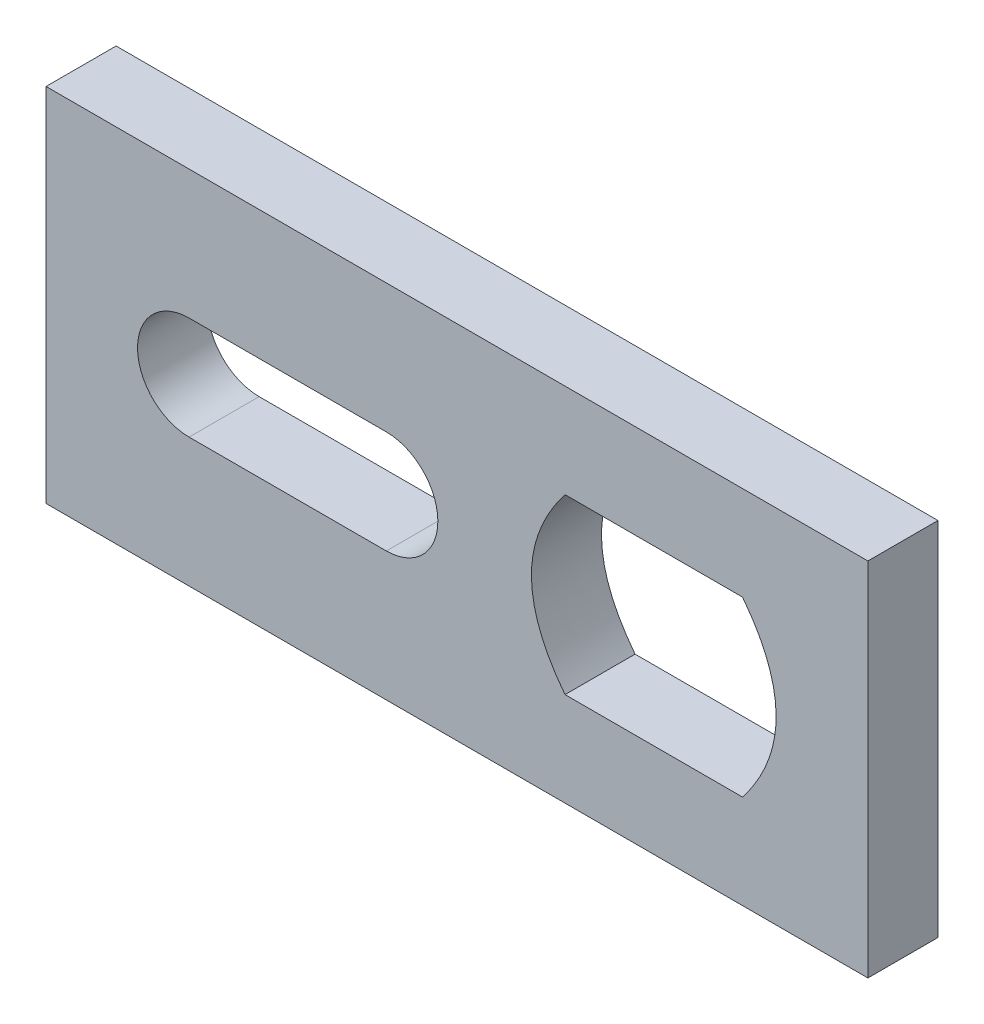
ISO-10303-21;
HEADER;
FILE_DESCRIPTION(('STEP AP214'),'2;1');
FILE_NAME('part.step','',(''),(''),'','','');
FILE_SCHEMA(('AUTOMOTIVE_DESIGN { 1 0 10303 214 1 1 1 1 }'));
ENDSEC;
DATA;
#1=APPLICATION_CONTEXT('core data for automotive mechanical design processes');
#2=APPLICATION_PROTOCOL_DEFINITION('international standard','automotive_design',2000,#1);
#3=PRODUCT_CONTEXT('',#1,'mechanical');
#4=PRODUCT('Part','Part','',(#3));
#5=PRODUCT_RELATED_PRODUCT_CATEGORY('part','',(#4));
#6=PRODUCT_DEFINITION_FORMATION('','',#4);
#7=PRODUCT_DEFINITION_CONTEXT('part definition',#1,'design');
#8=PRODUCT_DEFINITION('design','',#6,#7);
#9=PRODUCT_DEFINITION_SHAPE('','',#8);
#10=(LENGTH_UNIT() NAMED_UNIT(*) SI_UNIT(.MILLI.,.METRE.));
#11=(NAMED_UNIT(*) PLANE_ANGLE_UNIT() SI_UNIT($,.RADIAN.));
#12=(NAMED_UNIT(*) SI_UNIT($,.STERADIAN.) SOLID_ANGLE_UNIT());
#13=UNCERTAINTY_MEASURE_WITH_UNIT(LENGTH_MEASURE(1.E-05),#10,'distance_accuracy_value','');
#14=(GEOMETRIC_REPRESENTATION_CONTEXT(3) GLOBAL_UNCERTAINTY_ASSIGNED_CONTEXT((#13)) GLOBAL_UNIT_ASSIGNED_CONTEXT((#10,
#11,#12)) REPRESENTATION_CONTEXT('',''));
#15=CARTESIAN_POINT('',(0.,0.,0.));
#16=DIRECTION('',(0.,0.,1.));
#17=DIRECTION('',(1.,0.,0.));
#18=AXIS2_PLACEMENT_3D('',#15,#16,#17);
#19=CARTESIAN_POINT('',(0.,0.,5.81));
#20=DIRECTION('',(0.,1.,0.));
#21=DIRECTION('',(0.,0.,1.));
#22=AXIS2_PLACEMENT_3D('',#19,#20,#21);
#23=PLANE('',#22);
#24=DIRECTION('',(1.,0.,0.));
#25=VECTOR('',#24,1.);
#26=CARTESIAN_POINT('',(0.,0.,0.));
#27=LINE('',#26,#25);
#28=CARTESIAN_POINT('',(0.,0.,0.));
#29=VERTEX_POINT('',#28);
#30=CARTESIAN_POINT('',(68.15,0.,0.));
#31=VERTEX_POINT('',#30);
#32=EDGE_CURVE('E210',#29,#31,#27,.T.);
#33=ORIENTED_EDGE('',*,*,#32,.T.);
#34=DIRECTION('',(0.,0.,-1.));
#35=VECTOR('',#34,1.);
#36=CARTESIAN_POINT('',(68.15,0.,5.81));
#37=LINE('',#36,#35);
#38=CARTESIAN_POINT('',(68.15,0.,5.81));
#39=VERTEX_POINT('',#38);
#40=EDGE_CURVE('E11',#39,#31,#37,.T.);
#41=ORIENTED_EDGE('',*,*,#40,.F.);
#42=DIRECTION('',(1.,0.,0.));
#43=VECTOR('',#42,1.);
#44=CARTESIAN_POINT('',(0.,0.,5.81));
#45=LINE('',#44,#43);
#46=CARTESIAN_POINT('',(0.,0.,5.81));
#47=VERTEX_POINT('',#46);
#48=EDGE_CURVE('E149',#47,#39,#45,.T.);
#49=ORIENTED_EDGE('',*,*,#48,.F.);
#50=DIRECTION('',(0.,0.,-1.));
#51=VECTOR('',#50,1.);
#52=CARTESIAN_POINT('',(0.,0.,5.81));
#53=LINE('',#52,#51);
#54=EDGE_CURVE('E64',#47,#29,#53,.T.);
#55=ORIENTED_EDGE('',*,*,#54,.T.);
#56=EDGE_LOOP('',(#33,#41,#49,#55));
#57=FACE_BOUND('',#56,.T.);
#58=ADVANCED_FACE('F43',(#57),#23,.F.);
#59=CARTESIAN_POINT('',(68.15,0.,5.81));
#60=DIRECTION('',(-1.,0.,0.));
#61=DIRECTION('',(0.,0.,1.));
#62=AXIS2_PLACEMENT_3D('',#59,#60,#61);
#63=PLANE('',#62);
#64=DIRECTION('',(0.,1.,0.));
#65=VECTOR('',#64,1.);
#66=CARTESIAN_POINT('',(68.15,0.,0.));
#67=LINE('',#66,#65);
#68=CARTESIAN_POINT('',(68.15,29.95,0.));
#69=VERTEX_POINT('',#68);
#70=EDGE_CURVE('E156',#31,#69,#67,.T.);
#71=ORIENTED_EDGE('',*,*,#70,.T.);
#72=DIRECTION('',(0.,0.,-1.));
#73=VECTOR('',#72,1.);
#74=CARTESIAN_POINT('',(68.15,29.95,5.81));
#75=LINE('',#74,#73);
#76=CARTESIAN_POINT('',(68.15,29.95,5.81));
#77=VERTEX_POINT('',#76);
#78=EDGE_CURVE('E55',#77,#69,#75,.T.);
#79=ORIENTED_EDGE('',*,*,#78,.F.);
#80=DIRECTION('',(0.,1.,0.));
#81=VECTOR('',#80,1.);
#82=CARTESIAN_POINT('',(68.15,0.,5.81));
#83=LINE('',#82,#81);
#84=EDGE_CURVE('E143',#39,#77,#83,.T.);
#85=ORIENTED_EDGE('',*,*,#84,.F.);
#86=ORIENTED_EDGE('',*,*,#40,.T.);
#87=EDGE_LOOP('',(#71,#79,#85,#86));
#88=FACE_BOUND('',#87,.T.);
#89=ADVANCED_FACE('F155',(#88),#63,.F.);
#90=CARTESIAN_POINT('',(0.,29.95,5.81));
#91=DIRECTION('',(0.,1.,0.));
#92=DIRECTION('',(0.,0.,1.));
#93=AXIS2_PLACEMENT_3D('',#90,#91,#92);
#94=PLANE('',#93);
#95=DIRECTION('',(1.,0.,0.));
#96=VECTOR('',#95,1.);
#97=CARTESIAN_POINT('',(0.,29.95,0.));
#98=LINE('',#97,#96);
#99=CARTESIAN_POINT('',(0.,29.95,0.));
#100=VERTEX_POINT('',#99);
#101=EDGE_CURVE('E215',#100,#69,#98,.T.);
#102=ORIENTED_EDGE('',*,*,#101,.F.);
#103=DIRECTION('',(0.,0.,-1.));
#104=VECTOR('',#103,1.);
#105=CARTESIAN_POINT('',(0.,29.95,5.81));
#106=LINE('',#105,#104);
#107=CARTESIAN_POINT('',(0.,29.95,5.81));
#108=VERTEX_POINT('',#107);
#109=EDGE_CURVE('E102',#108,#100,#106,.T.);
#110=ORIENTED_EDGE('',*,*,#109,.F.);
#111=DIRECTION('',(1.,0.,0.));
#112=VECTOR('',#111,1.);
#113=CARTESIAN_POINT('',(0.,29.95,5.81));
#114=LINE('',#113,#112);
#115=EDGE_CURVE('E148',#108,#77,#114,.T.);
#116=ORIENTED_EDGE('',*,*,#115,.T.);
#117=ORIENTED_EDGE('',*,*,#78,.T.);
#118=EDGE_LOOP('',(#102,#110,#116,#117));
#119=FACE_BOUND('',#118,.T.);
#120=ADVANCED_FACE('F161',(#119),#94,.T.);
#121=CARTESIAN_POINT('',(0.,10.7,5.81));
#122=DIRECTION('',(0.,1.,0.));
#123=DIRECTION('',(-1.,0.,0.));
#124=AXIS2_PLACEMENT_3D('',#121,#122,#123);
#125=PLANE('',#124);
#126=DIRECTION('',(1.,0.,0.));
#127=VECTOR('',#126,1.);
#128=CARTESIAN_POINT('',(0.,10.7,0.));
#129=LINE('',#128,#127);
#130=CARTESIAN_POINT('',(11.86,10.7,0.));
#131=VERTEX_POINT('',#130);
#132=CARTESIAN_POINT('',(28.215,10.7,0.));
#133=VERTEX_POINT('',#132);
#134=EDGE_CURVE('E194',#131,#133,#129,.T.);
#135=ORIENTED_EDGE('',*,*,#134,.F.);
#136=DIRECTION('',(0.,0.,-1.));
#137=VECTOR('',#136,1.);
#138=CARTESIAN_POINT('',(11.86,10.7,5.81));
#139=LINE('',#138,#137);
#140=CARTESIAN_POINT('',(11.86,10.7,5.81));
#141=VERTEX_POINT('',#140);
#142=EDGE_CURVE('E224',#141,#131,#139,.T.);
#143=ORIENTED_EDGE('',*,*,#142,.F.);
#144=DIRECTION('',(1.,0.,0.));
#145=VECTOR('',#144,1.);
#146=CARTESIAN_POINT('',(0.,10.7,5.81));
#147=LINE('',#146,#145);
#148=CARTESIAN_POINT('',(28.215,10.7,5.81));
#149=VERTEX_POINT('',#148);
#150=EDGE_CURVE('E269',#141,#149,#147,.T.);
#151=ORIENTED_EDGE('',*,*,#150,.T.);
#152=DIRECTION('',(0.,0.,-1.));
#153=VECTOR('',#152,1.);
#154=CARTESIAN_POINT('',(28.215,10.7,5.81));
#155=LINE('',#154,#153);
#156=EDGE_CURVE('E227',#149,#133,#155,.T.);
#157=ORIENTED_EDGE('',*,*,#156,.T.);
#158=EDGE_LOOP('',(#135,#143,#151,#157));
#159=FACE_BOUND('',#158,.T.);
#160=ADVANCED_FACE('F309',(#159),#125,.T.);
#161=CARTESIAN_POINT('',(11.86,14.975,5.81));
#162=DIRECTION('',(0.,0.,-1.));
#163=DIRECTION('',(-1.,0.,0.));
#164=AXIS2_PLACEMENT_3D('',#161,#162,#163);
#165=CYLINDRICAL_SURFACE('',#164,4.275);
#166=CARTESIAN_POINT('',(11.86,14.975,0.));
#167=DIRECTION('',(0.,0.,1.));
#168=DIRECTION('',(1.,0.,0.));
#169=AXIS2_PLACEMENT_3D('',#166,#167,#168);
#170=CIRCLE('',#169,4.275);
#171=CARTESIAN_POINT('',(11.86,19.25,0.));
#172=VERTEX_POINT('',#171);
#173=EDGE_CURVE('E198',#172,#131,#170,.T.);
#174=ORIENTED_EDGE('',*,*,#173,.F.);
#175=DIRECTION('',(0.,0.,-1.));
#176=VECTOR('',#175,1.);
#177=CARTESIAN_POINT('',(11.86,19.25,5.81));
#178=LINE('',#177,#176);
#179=CARTESIAN_POINT('',(11.86,19.25,5.81));
#180=VERTEX_POINT('',#179);
#181=EDGE_CURVE('E233',#180,#172,#178,.T.);
#182=ORIENTED_EDGE('',*,*,#181,.F.);
#183=CARTESIAN_POINT('',(11.86,14.975,5.81));
#184=DIRECTION('',(0.,0.,1.));
#185=DIRECTION('',(1.,0.,0.));
#186=AXIS2_PLACEMENT_3D('',#183,#184,#185);
#187=CIRCLE('',#186,4.275);
#188=EDGE_CURVE('E275',#180,#141,#187,.T.);
#189=ORIENTED_EDGE('',*,*,#188,.T.);
#190=ORIENTED_EDGE('',*,*,#142,.T.);
#191=EDGE_LOOP('',(#174,#182,#189,#190));
#192=FACE_BOUND('',#191,.T.);
#193=ADVANCED_FACE('F311',(#192),#165,.F.);
#194=CARTESIAN_POINT('',(0.,19.25,5.81));
#195=DIRECTION('',(0.,1.,0.));
#196=DIRECTION('',(0.,0.,1.));
#197=AXIS2_PLACEMENT_3D('',#194,#195,#196);
#198=PLANE('',#197);
#199=DIRECTION('',(1.,0.,0.));
#200=VECTOR('',#199,1.);
#201=CARTESIAN_POINT('',(0.,19.25,0.));
#202=LINE('',#201,#200);
#203=CARTESIAN_POINT('',(28.215,19.25,0.));
#204=VERTEX_POINT('',#203);
#205=EDGE_CURVE('E202',#172,#204,#202,.T.);
#206=ORIENTED_EDGE('',*,*,#205,.T.);
#207=DIRECTION('',(0.,0.,-1.));
#208=VECTOR('',#207,1.);
#209=CARTESIAN_POINT('',(28.215,19.25,5.81));
#210=LINE('',#209,#208);
#211=CARTESIAN_POINT('',(28.215,19.25,5.81));
#212=VERTEX_POINT('',#211);
#213=EDGE_CURVE('E230',#212,#204,#210,.T.);
#214=ORIENTED_EDGE('',*,*,#213,.F.);
#215=DIRECTION('',(1.,0.,0.));
#216=VECTOR('',#215,1.);
#217=CARTESIAN_POINT('',(0.,19.25,5.81));
#218=LINE('',#217,#216);
#219=EDGE_CURVE('E286',#180,#212,#218,.T.);
#220=ORIENTED_EDGE('',*,*,#219,.F.);
#221=ORIENTED_EDGE('',*,*,#181,.T.);
#222=EDGE_LOOP('',(#206,#214,#220,#221));
#223=FACE_BOUND('',#222,.T.);
#224=ADVANCED_FACE('F303',(#223),#198,.F.);
#225=CARTESIAN_POINT('',(57.755,22.155,5.81));
#226=CARTESIAN_POINT('',(63.325,14.975,5.81));
#227=CARTESIAN_POINT('',(57.755,7.795,5.81));
#228=B_SPLINE_CURVE_WITH_KNOTS('',2,(#225,#226,#227),.UNSPECIFIED.,.F.,.F.,(3,3),(0.,1.),.UNSPECIFIED.);
#229=DIRECTION('',(0.,0.,-1.));
#230=VECTOR('',#229,1.);
#231=SURFACE_OF_LINEAR_EXTRUSION('',#228,#230);
#232=CARTESIAN_POINT('',(57.755,22.155,0.));
#233=CARTESIAN_POINT('',(63.325,14.975,0.));
#234=CARTESIAN_POINT('',(57.755,7.795,0.));
#235=B_SPLINE_CURVE_WITH_KNOTS('',2,(#232,#233,#234),.UNSPECIFIED.,.F.,.F.,(3,3),(0.,1.),.UNSPECIFIED.);
#236=CARTESIAN_POINT('',(57.755,22.155,0.));
#237=VERTEX_POINT('',#236);
#238=CARTESIAN_POINT('',(57.755,7.795,0.));
#239=VERTEX_POINT('',#238);
#240=EDGE_CURVE('E170',#237,#239,#235,.T.);
#241=ORIENTED_EDGE('',*,*,#240,.T.);
#242=DIRECTION('',(0.,0.,-1.));
#243=VECTOR('',#242,1.);
#244=CARTESIAN_POINT('',(57.755,7.795,5.81));
#245=LINE('',#244,#243);
#246=CARTESIAN_POINT('',(57.755,7.795,5.81));
#247=VERTEX_POINT('',#246);
#248=EDGE_CURVE('E48',#247,#239,#245,.T.);
#249=ORIENTED_EDGE('',*,*,#248,.F.);
#250=CARTESIAN_POINT('',(57.755,22.155,5.81));
#251=VERTEX_POINT('',#250);
#252=EDGE_CURVE('E115',#251,#247,#228,.T.);
#253=ORIENTED_EDGE('',*,*,#252,.F.);
#254=DIRECTION('',(0.,0.,-1.));
#255=VECTOR('',#254,1.);
#256=CARTESIAN_POINT('',(57.755,22.155,5.81));
#257=LINE('',#256,#255);
#258=EDGE_CURVE('E166',#251,#237,#257,.T.);
#259=ORIENTED_EDGE('',*,*,#258,.T.);
#260=EDGE_LOOP('',(#241,#249,#253,#259));
#261=FACE_BOUND('',#260,.T.);
#262=ADVANCED_FACE('F45',(#261),#231,.F.);
#263=CARTESIAN_POINT('',(0.,7.795,5.81));
#264=DIRECTION('',(0.,1.,0.));
#265=DIRECTION('',(0.,0.,1.));
#266=AXIS2_PLACEMENT_3D('',#263,#264,#265);
#267=PLANE('',#266);
#268=DIRECTION('',(1.,0.,0.));
#269=VECTOR('',#268,1.);
#270=CARTESIAN_POINT('',(0.,7.795,0.));
#271=LINE('',#270,#269);
#272=CARTESIAN_POINT('',(43.035,7.795,0.));
#273=VERTEX_POINT('',#272);
#274=EDGE_CURVE('E176',#273,#239,#271,.T.);
#275=ORIENTED_EDGE('',*,*,#274,.F.);
#276=DIRECTION('',(0.,0.,-1.));
#277=VECTOR('',#276,1.);
#278=CARTESIAN_POINT('',(43.035,7.795,5.81));
#279=LINE('',#278,#277);
#280=CARTESIAN_POINT('',(43.035,7.795,5.81));
#281=VERTEX_POINT('',#280);
#282=EDGE_CURVE('E244',#281,#273,#279,.T.);
#283=ORIENTED_EDGE('',*,*,#282,.F.);
#284=DIRECTION('',(1.,0.,0.));
#285=VECTOR('',#284,1.);
#286=CARTESIAN_POINT('',(0.,7.795,5.81));
#287=LINE('',#286,#285);
#288=EDGE_CURVE('E254',#281,#247,#287,.T.);
#289=ORIENTED_EDGE('',*,*,#288,.T.);
#290=ORIENTED_EDGE('',*,*,#248,.T.);
#291=EDGE_LOOP('',(#275,#283,#289,#290));
#292=FACE_BOUND('',#291,.T.);
#293=ADVANCED_FACE('F253',(#292),#267,.T.);
#294=CARTESIAN_POINT('',(43.035,7.795,5.81));
#295=CARTESIAN_POINT('',(37.465,14.975,5.81));
#296=CARTESIAN_POINT('',(43.035,22.155,5.81));
#297=B_SPLINE_CURVE_WITH_KNOTS('',2,(#294,#295,#296),.UNSPECIFIED.,.F.,.F.,(3,3),(0.,1.),.UNSPECIFIED.);
#298=DIRECTION('',(0.,0.,-1.));
#299=VECTOR('',#298,1.);
#300=SURFACE_OF_LINEAR_EXTRUSION('',#297,#299);
#301=CARTESIAN_POINT('',(43.035,7.795,0.));
#302=CARTESIAN_POINT('',(37.465,14.975,0.));
#303=CARTESIAN_POINT('',(43.035,22.155,0.));
#304=B_SPLINE_CURVE_WITH_KNOTS('',2,(#301,#302,#303),.UNSPECIFIED.,.F.,.F.,(3,3),(0.,1.),.UNSPECIFIED.);
#305=CARTESIAN_POINT('',(43.035,22.155,0.));
#306=VERTEX_POINT('',#305);
#307=EDGE_CURVE('E183',#273,#306,#304,.T.);
#308=ORIENTED_EDGE('',*,*,#307,.T.);
#309=DIRECTION('',(0.,0.,-1.));
#310=VECTOR('',#309,1.);
#311=CARTESIAN_POINT('',(43.035,22.155,5.81));
#312=LINE('',#311,#310);
#313=CARTESIAN_POINT('',(43.035,22.155,5.81));
#314=VERTEX_POINT('',#313);
#315=EDGE_CURVE('E241',#314,#306,#312,.T.);
#316=ORIENTED_EDGE('',*,*,#315,.F.);
#317=EDGE_CURVE('E270',#281,#314,#297,.T.);
#318=ORIENTED_EDGE('',*,*,#317,.F.);
#319=ORIENTED_EDGE('',*,*,#282,.T.);
#320=EDGE_LOOP('',(#308,#316,#318,#319));
#321=FACE_BOUND('',#320,.T.);
#322=ADVANCED_FACE('F263',(#321),#300,.F.);
#323=CARTESIAN_POINT('',(28.215,14.975,5.81));
#324=DIRECTION('',(0.,0.,-1.));
#325=DIRECTION('',(-1.,0.,0.));
#326=AXIS2_PLACEMENT_3D('',#323,#324,#325);
#327=CYLINDRICAL_SURFACE('',#326,4.275);
#328=CARTESIAN_POINT('',(28.215,14.975,0.));
#329=DIRECTION('',(0.,0.,1.));
#330=DIRECTION('',(1.,0.,0.));
#331=AXIS2_PLACEMENT_3D('',#328,#329,#330);
#332=CIRCLE('',#331,4.275);
#333=EDGE_CURVE('E206',#133,#204,#332,.T.);
#334=ORIENTED_EDGE('',*,*,#333,.F.);
#335=ORIENTED_EDGE('',*,*,#156,.F.);
#336=CARTESIAN_POINT('',(28.215,14.975,5.81));
#337=DIRECTION('',(0.,0.,1.));
#338=DIRECTION('',(1.,0.,0.));
#339=AXIS2_PLACEMENT_3D('',#336,#337,#338);
#340=CIRCLE('',#339,4.275);
#341=EDGE_CURVE('E289',#149,#212,#340,.T.);
#342=ORIENTED_EDGE('',*,*,#341,.T.);
#343=ORIENTED_EDGE('',*,*,#213,.T.);
#344=EDGE_LOOP('',(#334,#335,#342,#343));
#345=FACE_BOUND('',#344,.T.);
#346=ADVANCED_FACE('F296',(#345),#327,.F.);
#347=CARTESIAN_POINT('',(0.,22.155,5.81));
#348=DIRECTION('',(0.,1.,0.));
#349=DIRECTION('',(0.,0.,1.));
#350=AXIS2_PLACEMENT_3D('',#347,#348,#349);
#351=PLANE('',#350);
#352=DIRECTION('',(1.,0.,0.));
#353=VECTOR('',#352,1.);
#354=CARTESIAN_POINT('',(0.,22.155,0.));
#355=LINE('',#354,#353);
#356=EDGE_CURVE('E188',#306,#237,#355,.T.);
#357=ORIENTED_EDGE('',*,*,#356,.T.);
#358=ORIENTED_EDGE('',*,*,#258,.F.);
#359=DIRECTION('',(1.,0.,0.));
#360=VECTOR('',#359,1.);
#361=CARTESIAN_POINT('',(0.,22.155,5.81));
#362=LINE('',#361,#360);
#363=EDGE_CURVE('E267',#314,#251,#362,.T.);
#364=ORIENTED_EDGE('',*,*,#363,.F.);
#365=ORIENTED_EDGE('',*,*,#315,.T.);
#366=EDGE_LOOP('',(#357,#358,#364,#365));
#367=FACE_BOUND('',#366,.T.);
#368=ADVANCED_FACE('F266',(#367),#351,.F.);
#369=CARTESIAN_POINT('',(0.,0.,5.81));
#370=DIRECTION('',(-1.,0.,0.));
#371=DIRECTION('',(0.,0.,1.));
#372=AXIS2_PLACEMENT_3D('',#369,#370,#371);
#373=PLANE('',#372);
#374=DIRECTION('',(0.,1.,0.));
#375=VECTOR('',#374,1.);
#376=CARTESIAN_POINT('',(0.,0.,0.));
#377=LINE('',#376,#375);
#378=EDGE_CURVE('E218',#29,#100,#377,.T.);
#379=ORIENTED_EDGE('',*,*,#378,.F.);
#380=ORIENTED_EDGE('',*,*,#54,.F.);
#381=DIRECTION('',(0.,1.,0.));
#382=VECTOR('',#381,1.);
#383=CARTESIAN_POINT('',(0.,0.,5.81));
#384=LINE('',#383,#382);
#385=EDGE_CURVE('E163',#47,#108,#384,.T.);
#386=ORIENTED_EDGE('',*,*,#385,.T.);
#387=ORIENTED_EDGE('',*,*,#109,.T.);
#388=EDGE_LOOP('',(#379,#380,#386,#387));
#389=FACE_BOUND('',#388,.T.);
#390=ADVANCED_FACE('F333',(#389),#373,.T.);
#391=CARTESIAN_POINT('',(0.,0.,5.81));
#392=DIRECTION('',(0.,0.,1.));
#393=DIRECTION('',(1.,0.,0.));
#394=AXIS2_PLACEMENT_3D('',#391,#392,#393);
#395=PLANE('',#394);
#396=ORIENTED_EDGE('',*,*,#252,.T.);
#397=ORIENTED_EDGE('',*,*,#288,.F.);
#398=ORIENTED_EDGE('',*,*,#317,.T.);
#399=ORIENTED_EDGE('',*,*,#363,.T.);
#400=EDGE_LOOP('',(#396,#397,#398,#399));
#401=FACE_BOUND('',#400,.T.);
#402=ORIENTED_EDGE('',*,*,#150,.F.);
#403=ORIENTED_EDGE('',*,*,#188,.F.);
#404=ORIENTED_EDGE('',*,*,#219,.T.);
#405=ORIENTED_EDGE('',*,*,#341,.F.);
#406=EDGE_LOOP('',(#402,#403,#404,#405));
#407=FACE_BOUND('',#406,.T.);
#408=ORIENTED_EDGE('',*,*,#48,.T.);
#409=ORIENTED_EDGE('',*,*,#84,.T.);
#410=ORIENTED_EDGE('',*,*,#115,.F.);
#411=ORIENTED_EDGE('',*,*,#385,.F.);
#412=EDGE_LOOP('',(#408,#409,#410,#411));
#413=FACE_BOUND('',#412,.T.);
#414=ADVANCED_FACE('F145',(#401,#407,#413),#395,.T.);
#415=CARTESIAN_POINT('',(0.,0.,0.));
#416=DIRECTION('',(0.,0.,1.));
#417=DIRECTION('',(1.,0.,0.));
#418=AXIS2_PLACEMENT_3D('',#415,#416,#417);
#419=PLANE('',#418);
#420=ORIENTED_EDGE('',*,*,#240,.F.);
#421=ORIENTED_EDGE('',*,*,#356,.F.);
#422=ORIENTED_EDGE('',*,*,#307,.F.);
#423=ORIENTED_EDGE('',*,*,#274,.T.);
#424=EDGE_LOOP('',(#420,#421,#422,#423));
#425=FACE_BOUND('',#424,.T.);
#426=ORIENTED_EDGE('',*,*,#134,.T.);
#427=ORIENTED_EDGE('',*,*,#333,.T.);
#428=ORIENTED_EDGE('',*,*,#205,.F.);
#429=ORIENTED_EDGE('',*,*,#173,.T.);
#430=EDGE_LOOP('',(#426,#427,#428,#429));
#431=FACE_BOUND('',#430,.T.);
#432=ORIENTED_EDGE('',*,*,#32,.F.);
#433=ORIENTED_EDGE('',*,*,#378,.T.);
#434=ORIENTED_EDGE('',*,*,#101,.T.);
#435=ORIENTED_EDGE('',*,*,#70,.F.);
#436=EDGE_LOOP('',(#432,#433,#434,#435));
#437=FACE_BOUND('',#436,.T.);
#438=ADVANCED_FACE('F260',(#425,#431,#437),#419,.F.);
#439=CLOSED_SHELL('',(#58,#89,#120,#160,#193,#224,#262,#293,#322,#346,#368,#390,#414,#438));
#440=MANIFOLD_SOLID_BREP('B2',#439);
#441=ADVANCED_BREP_SHAPE_REPRESENTATION('',(#18,#440),#14);
#442=SHAPE_DEFINITION_REPRESENTATION(#9,#441);
ENDSEC;
END-ISO-10303-21;
